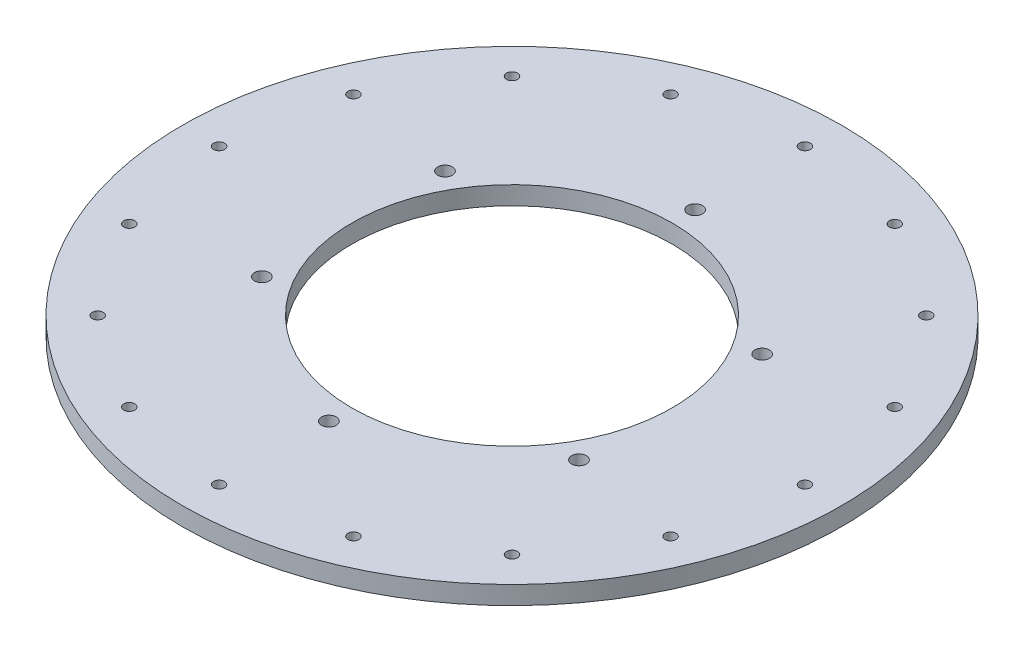
ISO-10303-21;
HEADER;
FILE_DESCRIPTION(('STEP AP214'),'2;1');
FILE_NAME('part.step','',(''),(''),'','','');
FILE_SCHEMA(('AUTOMOTIVE_DESIGN { 1 0 10303 214 1 1 1 1 }'));
ENDSEC;
DATA;
#1=APPLICATION_CONTEXT('core data for automotive mechanical design processes');
#2=APPLICATION_PROTOCOL_DEFINITION('international standard','automotive_design',2000,#1);
#3=PRODUCT_CONTEXT('',#1,'mechanical');
#4=PRODUCT('Part','Part','',(#3));
#5=PRODUCT_RELATED_PRODUCT_CATEGORY('part','',(#4));
#6=PRODUCT_DEFINITION_FORMATION('','',#4);
#7=PRODUCT_DEFINITION_CONTEXT('part definition',#1,'design');
#8=PRODUCT_DEFINITION('design','',#6,#7);
#9=PRODUCT_DEFINITION_SHAPE('','',#8);
#10=(LENGTH_UNIT() NAMED_UNIT(*) SI_UNIT(.MILLI.,.METRE.));
#11=(NAMED_UNIT(*) PLANE_ANGLE_UNIT() SI_UNIT($,.RADIAN.));
#12=(NAMED_UNIT(*) SI_UNIT($,.STERADIAN.) SOLID_ANGLE_UNIT());
#13=UNCERTAINTY_MEASURE_WITH_UNIT(LENGTH_MEASURE(1.E-05),#10,'distance_accuracy_value','');
#14=(GEOMETRIC_REPRESENTATION_CONTEXT(3) GLOBAL_UNCERTAINTY_ASSIGNED_CONTEXT((#13)) GLOBAL_UNIT_ASSIGNED_CONTEXT((#10,
#11,#12)) REPRESENTATION_CONTEXT('',''));
#15=CARTESIAN_POINT('',(0.,0.,0.));
#16=DIRECTION('',(0.,0.,1.));
#17=DIRECTION('',(1.,0.,0.));
#18=AXIS2_PLACEMENT_3D('',#15,#16,#17);
#19=CARTESIAN_POINT('',(0.,10.,0.));
#20=DIRECTION('',(0.,1.,0.));
#21=DIRECTION('',(0.,0.,1.));
#22=AXIS2_PLACEMENT_3D('',#19,#20,#21);
#23=PLANE('',#22);
#24=CARTESIAN_POINT('',(-113.137084989839,10.,-113.137084989827));
#25=DIRECTION('',(0.,1.,0.));
#26=DIRECTION('',(0.,0.,1.));
#27=AXIS2_PLACEMENT_3D('',#24,#25,#26);
#28=CIRCLE('',#27,3.00000000001628);
#29=CARTESIAN_POINT('',(-113.137084989839,10.,-110.13708498981));
#30=VERTEX_POINT('',#29);
#31=EDGE_CURVE('E168',#30,#30,#28,.T.);
#32=ORIENTED_EDGE('',*,*,#31,.F.);
#33=EDGE_LOOP('',(#32));
#34=FACE_BOUND('',#33,.T.);
#35=CARTESIAN_POINT('',(-159.99999999997,10.,2.95585778076202E-11));
#36=DIRECTION('',(0.,1.,0.));
#37=DIRECTION('',(0.,0.,1.));
#38=AXIS2_PLACEMENT_3D('',#35,#36,#37);
#39=CIRCLE('',#38,3.0000000000385);
#40=CARTESIAN_POINT('',(-159.99999999997,10.,3.00000000006806));
#41=VERTEX_POINT('',#40);
#42=EDGE_CURVE('E156',#41,#41,#39,.T.);
#43=ORIENTED_EDGE('',*,*,#42,.F.);
#44=EDGE_LOOP('',(#43));
#45=FACE_BOUND('',#44,.T.);
#46=CARTESIAN_POINT('',(-113.137084989797,10.,113.137084989869));
#47=DIRECTION('',(0.,1.,0.));
#48=DIRECTION('',(0.,0.,1.));
#49=AXIS2_PLACEMENT_3D('',#46,#47,#48);
#50=CIRCLE('',#49,3.00000000005567);
#51=CARTESIAN_POINT('',(-113.137084989797,10.,116.137084989924));
#52=VERTEX_POINT('',#51);
#53=EDGE_CURVE('E144',#52,#52,#50,.T.);
#54=ORIENTED_EDGE('',*,*,#53,.F.);
#55=EDGE_LOOP('',(#54));
#56=FACE_BOUND('',#55,.T.);
#57=CARTESIAN_POINT('',(5.90779669176676E-11,10.,160.));
#58=DIRECTION('',(0.,1.,0.));
#59=DIRECTION('',(0.,0.,1.));
#60=AXIS2_PLACEMENT_3D('',#57,#58,#59);
#61=CIRCLE('',#60,3.00000000005757);
#62=CARTESIAN_POINT('',(5.90779669176676E-11,10.,163.000000000058));
#63=VERTEX_POINT('',#62);
#64=EDGE_CURVE('E132',#63,#63,#61,.T.);
#65=ORIENTED_EDGE('',*,*,#64,.F.);
#66=EDGE_LOOP('',(#65));
#67=FACE_BOUND('',#66,.T.);
#68=CARTESIAN_POINT('',(113.137084989898,10.,113.137084989827));
#69=DIRECTION('',(0.,1.,0.));
#70=DIRECTION('',(0.,0.,1.));
#71=AXIS2_PLACEMENT_3D('',#68,#69,#70);
#72=CIRCLE('',#71,3.00000000004294);
#73=CARTESIAN_POINT('',(113.137084989898,10.,116.13708498987));
#74=VERTEX_POINT('',#73);
#75=EDGE_CURVE('E120',#74,#74,#72,.T.);
#76=ORIENTED_EDGE('',*,*,#75,.F.);
#77=EDGE_LOOP('',(#76));
#78=FACE_BOUND('',#77,.T.);
#79=CARTESIAN_POINT('',(160.00000000003,10.,-2.95389834588338E-11));
#80=DIRECTION('',(0.,1.,0.));
#81=DIRECTION('',(0.,0.,1.));
#82=AXIS2_PLACEMENT_3D('',#79,#80,#81);
#83=CIRCLE('',#82,3.00000000002015);
#84=CARTESIAN_POINT('',(160.00000000003,10.,2.99999999999062));
#85=VERTEX_POINT('',#84);
#86=EDGE_CURVE('E108',#85,#85,#83,.T.);
#87=ORIENTED_EDGE('',*,*,#86,.F.);
#88=EDGE_LOOP('',(#87));
#89=FACE_BOUND('',#88,.T.);
#90=CARTESIAN_POINT('',(-86.6025403784439,10.,-50.));
#91=DIRECTION('',(0.,1.,0.));
#92=DIRECTION('',(0.,0.,1.));
#93=AXIS2_PLACEMENT_3D('',#90,#91,#92);
#94=CIRCLE('',#93,4.00000000000001);
#95=CARTESIAN_POINT('',(-86.6025403784439,10.,-46.));
#96=VERTEX_POINT('',#95);
#97=EDGE_CURVE('E96',#96,#96,#94,.T.);
#98=ORIENTED_EDGE('',*,*,#97,.F.);
#99=EDGE_LOOP('',(#98));
#100=FACE_BOUND('',#99,.T.);
#101=CARTESIAN_POINT('',(61.2293491784166,10.,-147.820725201817));
#102=DIRECTION('',(0.,1.,0.));
#103=DIRECTION('',(0.,0.,1.));
#104=AXIS2_PLACEMENT_3D('',#101,#102,#103);
#105=CIRCLE('',#104,2.99999999999905);
#106=CARTESIAN_POINT('',(61.2293491784166,10.,-144.820725201818));
#107=VERTEX_POINT('',#106);
#108=EDGE_CURVE('E84',#107,#107,#105,.T.);
#109=ORIENTED_EDGE('',*,*,#108,.F.);
#110=EDGE_LOOP('',(#109));
#111=FACE_BOUND('',#110,.T.);
#112=CARTESIAN_POINT('',(0.,10.,100.));
#113=DIRECTION('',(0.,1.,0.));
#114=DIRECTION('',(0.,0.,1.));
#115=AXIS2_PLACEMENT_3D('',#112,#113,#114);
#116=CIRCLE('',#115,4.);
#117=CARTESIAN_POINT('',(0.,10.,104.));
#118=VERTEX_POINT('',#117);
#119=EDGE_CURVE('E72',#118,#118,#116,.T.);
#120=ORIENTED_EDGE('',*,*,#119,.F.);
#121=EDGE_LOOP('',(#120));
#122=FACE_BOUND('',#121,.T.);
#123=CARTESIAN_POINT('',(86.6025403784438,10.,-50.));
#124=DIRECTION('',(0.,1.,0.));
#125=DIRECTION('',(0.,0.,1.));
#126=AXIS2_PLACEMENT_3D('',#123,#124,#125);
#127=CIRCLE('',#126,4.00000000000001);
#128=CARTESIAN_POINT('',(86.6025403784438,10.,-46.));
#129=VERTEX_POINT('',#128);
#130=EDGE_CURVE('E60',#129,#129,#127,.T.);
#131=ORIENTED_EDGE('',*,*,#130,.F.);
#132=EDGE_LOOP('',(#131));
#133=FACE_BOUND('',#132,.T.);
#134=CARTESIAN_POINT('',(0.,10.,-100.));
#135=DIRECTION('',(0.,1.,0.));
#136=DIRECTION('',(0.,0.,1.));
#137=AXIS2_PLACEMENT_3D('',#134,#135,#136);
#138=CIRCLE('',#137,4.);
#139=CARTESIAN_POINT('',(0.,10.,-96.));
#140=VERTEX_POINT('',#139);
#141=EDGE_CURVE('E48',#140,#140,#138,.T.);
#142=ORIENTED_EDGE('',*,*,#141,.F.);
#143=EDGE_LOOP('',(#142));
#144=FACE_BOUND('',#143,.T.);
#145=CARTESIAN_POINT('',(0.,10.,0.));
#146=DIRECTION('',(0.,1.,0.));
#147=DIRECTION('',(0.,0.,1.));
#148=AXIS2_PLACEMENT_3D('',#145,#146,#147);
#149=CIRCLE('',#148,180.);
#150=CARTESIAN_POINT('',(0.,10.,180.));
#151=VERTEX_POINT('',#150);
#152=EDGE_CURVE('E10',#151,#151,#149,.T.);
#153=ORIENTED_EDGE('',*,*,#152,.T.);
#154=EDGE_LOOP('',(#153));
#155=FACE_BOUND('',#154,.T.);
#156=CARTESIAN_POINT('',(0.,10.,0.));
#157=DIRECTION('',(0.,1.,0.));
#158=DIRECTION('',(0.,0.,1.));
#159=AXIS2_PLACEMENT_3D('',#156,#157,#158);
#160=CIRCLE('',#159,87.5);
#161=CARTESIAN_POINT('',(0.,10.,87.5));
#162=VERTEX_POINT('',#161);
#163=EDGE_CURVE('E43',#162,#162,#160,.T.);
#164=ORIENTED_EDGE('',*,*,#163,.F.);
#165=EDGE_LOOP('',(#164));
#166=FACE_BOUND('',#165,.T.);
#167=CARTESIAN_POINT('',(0.,10.,-160.));
#168=DIRECTION('',(0.,1.,0.));
#169=DIRECTION('',(0.,0.,1.));
#170=AXIS2_PLACEMENT_3D('',#167,#168,#169);
#171=CIRCLE('',#170,3.);
#172=CARTESIAN_POINT('',(0.,10.,-157.));
#173=VERTEX_POINT('',#172);
#174=EDGE_CURVE('E54',#173,#173,#171,.T.);
#175=ORIENTED_EDGE('',*,*,#174,.F.);
#176=EDGE_LOOP('',(#175));
#177=FACE_BOUND('',#176,.T.);
#178=CARTESIAN_POINT('',(86.6025403784438,10.,50.));
#179=DIRECTION('',(0.,1.,0.));
#180=DIRECTION('',(0.,0.,1.));
#181=AXIS2_PLACEMENT_3D('',#178,#179,#180);
#182=CIRCLE('',#181,4.00000000000001);
#183=CARTESIAN_POINT('',(86.6025403784438,10.,54.));
#184=VERTEX_POINT('',#183);
#185=EDGE_CURVE('E66',#184,#184,#182,.T.);
#186=ORIENTED_EDGE('',*,*,#185,.F.);
#187=EDGE_LOOP('',(#186));
#188=FACE_BOUND('',#187,.T.);
#189=CARTESIAN_POINT('',(-86.6025403784439,10.,50.));
#190=DIRECTION('',(0.,1.,0.));
#191=DIRECTION('',(0.,0.,1.));
#192=AXIS2_PLACEMENT_3D('',#189,#190,#191);
#193=CIRCLE('',#192,4.00000000000001);
#194=CARTESIAN_POINT('',(-86.6025403784439,10.,54.));
#195=VERTEX_POINT('',#194);
#196=EDGE_CURVE('E78',#195,#195,#193,.T.);
#197=ORIENTED_EDGE('',*,*,#196,.F.);
#198=EDGE_LOOP('',(#197));
#199=FACE_BOUND('',#198,.T.);
#200=CARTESIAN_POINT('',(113.137084989856,10.,-113.137084989869));
#201=DIRECTION('',(0.,1.,0.));
#202=DIRECTION('',(0.,0.,1.));
#203=AXIS2_PLACEMENT_3D('',#200,#201,#202);
#204=CIRCLE('',#203,3.00000000000243);
#205=CARTESIAN_POINT('',(113.137084989856,10.,-110.137084989866));
#206=VERTEX_POINT('',#205);
#207=EDGE_CURVE('E90',#206,#206,#204,.T.);
#208=ORIENTED_EDGE('',*,*,#207,.F.);
#209=EDGE_LOOP('',(#208));
#210=FACE_BOUND('',#209,.T.);
#211=CARTESIAN_POINT('',(147.820725201824,10.,-61.2293491784417));
#212=DIRECTION('',(0.,1.,0.));
#213=DIRECTION('',(0.,0.,1.));
#214=AXIS2_PLACEMENT_3D('',#211,#212,#213);
#215=CIRCLE('',#214,3.00000000000983);
#216=CARTESIAN_POINT('',(147.820725201824,10.,-58.2293491784318));
#217=VERTEX_POINT('',#216);
#218=EDGE_CURVE('E102',#217,#217,#215,.T.);
#219=ORIENTED_EDGE('',*,*,#218,.F.);
#220=EDGE_LOOP('',(#219));
#221=FACE_BOUND('',#220,.T.);
#222=CARTESIAN_POINT('',(147.820725201847,10.,61.2293491783871));
#223=DIRECTION('',(0.,1.,0.));
#224=DIRECTION('',(0.,0.,1.));
#225=AXIS2_PLACEMENT_3D('',#222,#223,#224);
#226=CIRCLE('',#225,3.00000000003175);
#227=CARTESIAN_POINT('',(147.820725201847,10.,64.2293491784188));
#228=VERTEX_POINT('',#227);
#229=EDGE_CURVE('E114',#228,#228,#226,.T.);
#230=ORIENTED_EDGE('',*,*,#229,.F.);
#231=EDGE_LOOP('',(#230));
#232=FACE_BOUND('',#231,.T.);
#233=CARTESIAN_POINT('',(61.2293491784712,10.,147.820725201795));
#234=DIRECTION('',(0.,1.,0.));
#235=DIRECTION('',(0.,0.,1.));
#236=AXIS2_PLACEMENT_3D('',#233,#234,#235);
#237=CIRCLE('',#236,3.00000000005197);
#238=CARTESIAN_POINT('',(61.2293491784712,10.,150.820725201847));
#239=VERTEX_POINT('',#238);
#240=EDGE_CURVE('E126',#239,#239,#237,.T.);
#241=ORIENTED_EDGE('',*,*,#240,.F.);
#242=EDGE_LOOP('',(#241));
#243=FACE_BOUND('',#242,.T.);
#244=CARTESIAN_POINT('',(-61.2293491783575,10.,147.820725201817));
#245=DIRECTION('',(0.,1.,0.));
#246=DIRECTION('',(0.,0.,1.));
#247=AXIS2_PLACEMENT_3D('',#244,#245,#246);
#248=CIRCLE('',#247,3.00000000005889);
#249=CARTESIAN_POINT('',(-61.2293491783575,10.,150.820725201876));
#250=VERTEX_POINT('',#249);
#251=EDGE_CURVE('E138',#250,#250,#248,.T.);
#252=ORIENTED_EDGE('',*,*,#251,.F.);
#253=EDGE_LOOP('',(#252));
#254=FACE_BOUND('',#253,.T.);
#255=CARTESIAN_POINT('',(-147.820725201765,10.,61.2293491784417));
#256=DIRECTION('',(0.,1.,0.));
#257=DIRECTION('',(0.,0.,1.));
#258=AXIS2_PLACEMENT_3D('',#255,#256,#257);
#259=CIRCLE('',#258,3.00000000004867);
#260=CARTESIAN_POINT('',(-147.820725201765,10.,64.2293491784904));
#261=VERTEX_POINT('',#260);
#262=EDGE_CURVE('E150',#261,#261,#259,.T.);
#263=ORIENTED_EDGE('',*,*,#262,.F.);
#264=EDGE_LOOP('',(#263));
#265=FACE_BOUND('',#264,.T.);
#266=CARTESIAN_POINT('',(-147.820725201788,10.,-61.2293491783871));
#267=DIRECTION('',(0.,1.,0.));
#268=DIRECTION('',(0.,0.,1.));
#269=AXIS2_PLACEMENT_3D('',#266,#267,#268);
#270=CIRCLE('',#269,3.00000000002704);
#271=CARTESIAN_POINT('',(-147.820725201788,10.,-58.2293491783601));
#272=VERTEX_POINT('',#271);
#273=EDGE_CURVE('E162',#272,#272,#270,.T.);
#274=ORIENTED_EDGE('',*,*,#273,.F.);
#275=EDGE_LOOP('',(#274));
#276=FACE_BOUND('',#275,.T.);
#277=CARTESIAN_POINT('',(-61.2293491784122,10.,-147.820725201795));
#278=DIRECTION('',(0.,1.,0.));
#279=DIRECTION('',(0.,0.,1.));
#280=AXIS2_PLACEMENT_3D('',#277,#278,#279);
#281=CIRCLE('',#280,3.00000000000766);
#282=CARTESIAN_POINT('',(-61.2293491784122,10.,-144.820725201787));
#283=VERTEX_POINT('',#282);
#284=EDGE_CURVE('E174',#283,#283,#281,.T.);
#285=ORIENTED_EDGE('',*,*,#284,.F.);
#286=EDGE_LOOP('',(#285));
#287=FACE_BOUND('',#286,.T.);
#288=ADVANCED_FACE('F32',(#34,#45,#56,#67,#78,#89,#100,#111,#122,#133,#144,#155,#166,#177,#188,
#199,#210,#221,#232,#243,#254,#265,#276,#287),#23,.T.);
#289=CARTESIAN_POINT('',(0.,0.,0.));
#290=DIRECTION('',(0.,1.,0.));
#291=DIRECTION('',(0.,0.,1.));
#292=AXIS2_PLACEMENT_3D('',#289,#290,#291);
#293=PLANE('',#292);
#294=CARTESIAN_POINT('',(0.,0.,0.));
#295=DIRECTION('',(0.,1.,0.));
#296=DIRECTION('',(0.,0.,1.));
#297=AXIS2_PLACEMENT_3D('',#294,#295,#296);
#298=CIRCLE('',#297,180.);
#299=CARTESIAN_POINT('',(0.,0.,180.));
#300=VERTEX_POINT('',#299);
#301=EDGE_CURVE('E36',#300,#300,#298,.T.);
#302=ORIENTED_EDGE('',*,*,#301,.F.);
#303=EDGE_LOOP('',(#302));
#304=FACE_BOUND('',#303,.T.);
#305=CARTESIAN_POINT('',(0.,0.,0.));
#306=DIRECTION('',(0.,1.,0.));
#307=DIRECTION('',(0.,0.,1.));
#308=AXIS2_PLACEMENT_3D('',#305,#306,#307);
#309=CIRCLE('',#308,87.5);
#310=CARTESIAN_POINT('',(0.,0.,87.5));
#311=VERTEX_POINT('',#310);
#312=EDGE_CURVE('E45',#311,#311,#309,.T.);
#313=ORIENTED_EDGE('',*,*,#312,.T.);
#314=EDGE_LOOP('',(#313));
#315=FACE_BOUND('',#314,.T.);
#316=CARTESIAN_POINT('',(0.,0.,-100.));
#317=DIRECTION('',(0.,1.,0.));
#318=DIRECTION('',(0.,0.,1.));
#319=AXIS2_PLACEMENT_3D('',#316,#317,#318);
#320=CIRCLE('',#319,4.);
#321=CARTESIAN_POINT('',(0.,0.,-96.));
#322=VERTEX_POINT('',#321);
#323=EDGE_CURVE('E51',#322,#322,#320,.T.);
#324=ORIENTED_EDGE('',*,*,#323,.T.);
#325=EDGE_LOOP('',(#324));
#326=FACE_BOUND('',#325,.T.);
#327=CARTESIAN_POINT('',(0.,0.,-160.));
#328=DIRECTION('',(0.,1.,0.));
#329=DIRECTION('',(0.,0.,1.));
#330=AXIS2_PLACEMENT_3D('',#327,#328,#329);
#331=CIRCLE('',#330,3.);
#332=CARTESIAN_POINT('',(0.,0.,-157.));
#333=VERTEX_POINT('',#332);
#334=EDGE_CURVE('E57',#333,#333,#331,.T.);
#335=ORIENTED_EDGE('',*,*,#334,.T.);
#336=EDGE_LOOP('',(#335));
#337=FACE_BOUND('',#336,.T.);
#338=CARTESIAN_POINT('',(86.6025403784438,0.,-50.));
#339=DIRECTION('',(0.,1.,0.));
#340=DIRECTION('',(0.,0.,1.));
#341=AXIS2_PLACEMENT_3D('',#338,#339,#340);
#342=CIRCLE('',#341,4.00000000000001);
#343=CARTESIAN_POINT('',(86.6025403784438,0.,-46.));
#344=VERTEX_POINT('',#343);
#345=EDGE_CURVE('E63',#344,#344,#342,.T.);
#346=ORIENTED_EDGE('',*,*,#345,.T.);
#347=EDGE_LOOP('',(#346));
#348=FACE_BOUND('',#347,.T.);
#349=CARTESIAN_POINT('',(86.6025403784438,0.,50.));
#350=DIRECTION('',(0.,1.,0.));
#351=DIRECTION('',(0.,0.,1.));
#352=AXIS2_PLACEMENT_3D('',#349,#350,#351);
#353=CIRCLE('',#352,4.00000000000001);
#354=CARTESIAN_POINT('',(86.6025403784438,0.,54.));
#355=VERTEX_POINT('',#354);
#356=EDGE_CURVE('E69',#355,#355,#353,.T.);
#357=ORIENTED_EDGE('',*,*,#356,.T.);
#358=EDGE_LOOP('',(#357));
#359=FACE_BOUND('',#358,.T.);
#360=CARTESIAN_POINT('',(0.,0.,100.));
#361=DIRECTION('',(0.,1.,0.));
#362=DIRECTION('',(0.,0.,1.));
#363=AXIS2_PLACEMENT_3D('',#360,#361,#362);
#364=CIRCLE('',#363,4.);
#365=CARTESIAN_POINT('',(0.,0.,104.));
#366=VERTEX_POINT('',#365);
#367=EDGE_CURVE('E75',#366,#366,#364,.T.);
#368=ORIENTED_EDGE('',*,*,#367,.T.);
#369=EDGE_LOOP('',(#368));
#370=FACE_BOUND('',#369,.T.);
#371=CARTESIAN_POINT('',(-86.6025403784439,0.,50.));
#372=DIRECTION('',(0.,1.,0.));
#373=DIRECTION('',(0.,0.,1.));
#374=AXIS2_PLACEMENT_3D('',#371,#372,#373);
#375=CIRCLE('',#374,4.00000000000001);
#376=CARTESIAN_POINT('',(-86.6025403784439,0.,54.));
#377=VERTEX_POINT('',#376);
#378=EDGE_CURVE('E81',#377,#377,#375,.T.);
#379=ORIENTED_EDGE('',*,*,#378,.T.);
#380=EDGE_LOOP('',(#379));
#381=FACE_BOUND('',#380,.T.);
#382=CARTESIAN_POINT('',(61.2293491784166,0.,-147.820725201817));
#383=DIRECTION('',(0.,1.,0.));
#384=DIRECTION('',(0.,0.,1.));
#385=AXIS2_PLACEMENT_3D('',#382,#383,#384);
#386=CIRCLE('',#385,2.99999999999905);
#387=CARTESIAN_POINT('',(61.2293491784166,0.,-144.820725201818));
#388=VERTEX_POINT('',#387);
#389=EDGE_CURVE('E87',#388,#388,#386,.T.);
#390=ORIENTED_EDGE('',*,*,#389,.T.);
#391=EDGE_LOOP('',(#390));
#392=FACE_BOUND('',#391,.T.);
#393=CARTESIAN_POINT('',(113.137084989856,0.,-113.137084989869));
#394=DIRECTION('',(0.,1.,0.));
#395=DIRECTION('',(0.,0.,1.));
#396=AXIS2_PLACEMENT_3D('',#393,#394,#395);
#397=CIRCLE('',#396,3.00000000000243);
#398=CARTESIAN_POINT('',(113.137084989856,0.,-110.137084989866));
#399=VERTEX_POINT('',#398);
#400=EDGE_CURVE('E93',#399,#399,#397,.T.);
#401=ORIENTED_EDGE('',*,*,#400,.T.);
#402=EDGE_LOOP('',(#401));
#403=FACE_BOUND('',#402,.T.);
#404=CARTESIAN_POINT('',(-86.6025403784439,0.,-50.));
#405=DIRECTION('',(0.,1.,0.));
#406=DIRECTION('',(0.,0.,1.));
#407=AXIS2_PLACEMENT_3D('',#404,#405,#406);
#408=CIRCLE('',#407,4.00000000000001);
#409=CARTESIAN_POINT('',(-86.6025403784439,0.,-46.));
#410=VERTEX_POINT('',#409);
#411=EDGE_CURVE('E99',#410,#410,#408,.T.);
#412=ORIENTED_EDGE('',*,*,#411,.T.);
#413=EDGE_LOOP('',(#412));
#414=FACE_BOUND('',#413,.T.);
#415=CARTESIAN_POINT('',(147.820725201824,0.,-61.2293491784417));
#416=DIRECTION('',(0.,1.,0.));
#417=DIRECTION('',(0.,0.,1.));
#418=AXIS2_PLACEMENT_3D('',#415,#416,#417);
#419=CIRCLE('',#418,3.00000000000983);
#420=CARTESIAN_POINT('',(147.820725201824,0.,-58.2293491784318));
#421=VERTEX_POINT('',#420);
#422=EDGE_CURVE('E105',#421,#421,#419,.T.);
#423=ORIENTED_EDGE('',*,*,#422,.T.);
#424=EDGE_LOOP('',(#423));
#425=FACE_BOUND('',#424,.T.);
#426=CARTESIAN_POINT('',(160.00000000003,0.,-2.95389834588338E-11));
#427=DIRECTION('',(0.,1.,0.));
#428=DIRECTION('',(0.,0.,1.));
#429=AXIS2_PLACEMENT_3D('',#426,#427,#428);
#430=CIRCLE('',#429,3.00000000002015);
#431=CARTESIAN_POINT('',(160.00000000003,0.,2.99999999999062));
#432=VERTEX_POINT('',#431);
#433=EDGE_CURVE('E111',#432,#432,#430,.T.);
#434=ORIENTED_EDGE('',*,*,#433,.T.);
#435=EDGE_LOOP('',(#434));
#436=FACE_BOUND('',#435,.T.);
#437=CARTESIAN_POINT('',(147.820725201847,0.,61.2293491783871));
#438=DIRECTION('',(0.,1.,0.));
#439=DIRECTION('',(0.,0.,1.));
#440=AXIS2_PLACEMENT_3D('',#437,#438,#439);
#441=CIRCLE('',#440,3.00000000003175);
#442=CARTESIAN_POINT('',(147.820725201847,0.,64.2293491784188));
#443=VERTEX_POINT('',#442);
#444=EDGE_CURVE('E117',#443,#443,#441,.T.);
#445=ORIENTED_EDGE('',*,*,#444,.T.);
#446=EDGE_LOOP('',(#445));
#447=FACE_BOUND('',#446,.T.);
#448=CARTESIAN_POINT('',(113.137084989898,0.,113.137084989827));
#449=DIRECTION('',(0.,1.,0.));
#450=DIRECTION('',(0.,0.,1.));
#451=AXIS2_PLACEMENT_3D('',#448,#449,#450);
#452=CIRCLE('',#451,3.00000000004294);
#453=CARTESIAN_POINT('',(113.137084989898,0.,116.13708498987));
#454=VERTEX_POINT('',#453);
#455=EDGE_CURVE('E123',#454,#454,#452,.T.);
#456=ORIENTED_EDGE('',*,*,#455,.T.);
#457=EDGE_LOOP('',(#456));
#458=FACE_BOUND('',#457,.T.);
#459=CARTESIAN_POINT('',(61.2293491784712,0.,147.820725201795));
#460=DIRECTION('',(0.,1.,0.));
#461=DIRECTION('',(0.,0.,1.));
#462=AXIS2_PLACEMENT_3D('',#459,#460,#461);
#463=CIRCLE('',#462,3.00000000005197);
#464=CARTESIAN_POINT('',(61.2293491784712,0.,150.820725201847));
#465=VERTEX_POINT('',#464);
#466=EDGE_CURVE('E129',#465,#465,#463,.T.);
#467=ORIENTED_EDGE('',*,*,#466,.T.);
#468=EDGE_LOOP('',(#467));
#469=FACE_BOUND('',#468,.T.);
#470=CARTESIAN_POINT('',(5.90779669176676E-11,0.,160.));
#471=DIRECTION('',(0.,1.,0.));
#472=DIRECTION('',(0.,0.,1.));
#473=AXIS2_PLACEMENT_3D('',#470,#471,#472);
#474=CIRCLE('',#473,3.00000000005757);
#475=CARTESIAN_POINT('',(5.90779669176676E-11,0.,163.000000000058));
#476=VERTEX_POINT('',#475);
#477=EDGE_CURVE('E135',#476,#476,#474,.T.);
#478=ORIENTED_EDGE('',*,*,#477,.T.);
#479=EDGE_LOOP('',(#478));
#480=FACE_BOUND('',#479,.T.);
#481=CARTESIAN_POINT('',(-61.2293491783575,0.,147.820725201817));
#482=DIRECTION('',(0.,1.,0.));
#483=DIRECTION('',(0.,0.,1.));
#484=AXIS2_PLACEMENT_3D('',#481,#482,#483);
#485=CIRCLE('',#484,3.00000000005889);
#486=CARTESIAN_POINT('',(-61.2293491783575,0.,150.820725201876));
#487=VERTEX_POINT('',#486);
#488=EDGE_CURVE('E141',#487,#487,#485,.T.);
#489=ORIENTED_EDGE('',*,*,#488,.T.);
#490=EDGE_LOOP('',(#489));
#491=FACE_BOUND('',#490,.T.);
#492=CARTESIAN_POINT('',(-113.137084989797,0.,113.137084989869));
#493=DIRECTION('',(0.,1.,0.));
#494=DIRECTION('',(0.,0.,1.));
#495=AXIS2_PLACEMENT_3D('',#492,#493,#494);
#496=CIRCLE('',#495,3.00000000005567);
#497=CARTESIAN_POINT('',(-113.137084989797,0.,116.137084989924));
#498=VERTEX_POINT('',#497);
#499=EDGE_CURVE('E147',#498,#498,#496,.T.);
#500=ORIENTED_EDGE('',*,*,#499,.T.);
#501=EDGE_LOOP('',(#500));
#502=FACE_BOUND('',#501,.T.);
#503=CARTESIAN_POINT('',(-147.820725201765,0.,61.2293491784417));
#504=DIRECTION('',(0.,1.,0.));
#505=DIRECTION('',(0.,0.,1.));
#506=AXIS2_PLACEMENT_3D('',#503,#504,#505);
#507=CIRCLE('',#506,3.00000000004867);
#508=CARTESIAN_POINT('',(-147.820725201765,0.,64.2293491784904));
#509=VERTEX_POINT('',#508);
#510=EDGE_CURVE('E153',#509,#509,#507,.T.);
#511=ORIENTED_EDGE('',*,*,#510,.T.);
#512=EDGE_LOOP('',(#511));
#513=FACE_BOUND('',#512,.T.);
#514=CARTESIAN_POINT('',(-159.99999999997,0.,2.95585778076202E-11));
#515=DIRECTION('',(0.,1.,0.));
#516=DIRECTION('',(0.,0.,1.));
#517=AXIS2_PLACEMENT_3D('',#514,#515,#516);
#518=CIRCLE('',#517,3.0000000000385);
#519=CARTESIAN_POINT('',(-159.99999999997,0.,3.00000000006806));
#520=VERTEX_POINT('',#519);
#521=EDGE_CURVE('E159',#520,#520,#518,.T.);
#522=ORIENTED_EDGE('',*,*,#521,.T.);
#523=EDGE_LOOP('',(#522));
#524=FACE_BOUND('',#523,.T.);
#525=CARTESIAN_POINT('',(-147.820725201788,0.,-61.2293491783871));
#526=DIRECTION('',(0.,1.,0.));
#527=DIRECTION('',(0.,0.,1.));
#528=AXIS2_PLACEMENT_3D('',#525,#526,#527);
#529=CIRCLE('',#528,3.00000000002704);
#530=CARTESIAN_POINT('',(-147.820725201788,0.,-58.2293491783601));
#531=VERTEX_POINT('',#530);
#532=EDGE_CURVE('E165',#531,#531,#529,.T.);
#533=ORIENTED_EDGE('',*,*,#532,.T.);
#534=EDGE_LOOP('',(#533));
#535=FACE_BOUND('',#534,.T.);
#536=CARTESIAN_POINT('',(-113.137084989839,0.,-113.137084989827));
#537=DIRECTION('',(0.,1.,0.));
#538=DIRECTION('',(0.,0.,1.));
#539=AXIS2_PLACEMENT_3D('',#536,#537,#538);
#540=CIRCLE('',#539,3.00000000001628);
#541=CARTESIAN_POINT('',(-113.137084989839,0.,-110.13708498981));
#542=VERTEX_POINT('',#541);
#543=EDGE_CURVE('E171',#542,#542,#540,.T.);
#544=ORIENTED_EDGE('',*,*,#543,.T.);
#545=EDGE_LOOP('',(#544));
#546=FACE_BOUND('',#545,.T.);
#547=CARTESIAN_POINT('',(-61.2293491784122,0.,-147.820725201795));
#548=DIRECTION('',(0.,1.,0.));
#549=DIRECTION('',(0.,0.,1.));
#550=AXIS2_PLACEMENT_3D('',#547,#548,#549);
#551=CIRCLE('',#550,3.00000000000766);
#552=CARTESIAN_POINT('',(-61.2293491784122,0.,-144.820725201787));
#553=VERTEX_POINT('',#552);
#554=EDGE_CURVE('E177',#553,#553,#551,.T.);
#555=ORIENTED_EDGE('',*,*,#554,.T.);
#556=EDGE_LOOP('',(#555));
#557=FACE_BOUND('',#556,.T.);
#558=ADVANCED_FACE('F187',(#304,#315,#326,#337,#348,#359,#370,#381,#392,#403,#414,#425,#436,
#447,#458,#469,#480,#491,#502,#513,#524,#535,#546,#557),#293,.F.);
#559=CARTESIAN_POINT('',(0.,10.,0.));
#560=DIRECTION('',(0.,-1.,0.));
#561=DIRECTION('',(0.,0.,-1.));
#562=AXIS2_PLACEMENT_3D('',#559,#560,#561);
#563=CYLINDRICAL_SURFACE('',#562,180.);
#564=ORIENTED_EDGE('',*,*,#152,.F.);
#565=EDGE_LOOP('',(#564));
#566=FACE_BOUND('',#565,.T.);
#567=ORIENTED_EDGE('',*,*,#301,.T.);
#568=EDGE_LOOP('',(#567));
#569=FACE_BOUND('',#568,.T.);
#570=ADVANCED_FACE('F34',(#566,#569),#563,.T.);
#571=CARTESIAN_POINT('',(0.,10.,0.));
#572=DIRECTION('',(0.,-1.,0.));
#573=DIRECTION('',(0.,0.,-1.));
#574=AXIS2_PLACEMENT_3D('',#571,#572,#573);
#575=CYLINDRICAL_SURFACE('',#574,87.5);
#576=ORIENTED_EDGE('',*,*,#163,.T.);
#577=EDGE_LOOP('',(#576));
#578=FACE_BOUND('',#577,.T.);
#579=ORIENTED_EDGE('',*,*,#312,.F.);
#580=EDGE_LOOP('',(#579));
#581=FACE_BOUND('',#580,.T.);
#582=ADVANCED_FACE('F197',(#578,#581),#575,.F.);
#583=CARTESIAN_POINT('',(0.,10.,-100.));
#584=DIRECTION('',(0.,-1.,0.));
#585=DIRECTION('',(0.,0.,-1.));
#586=AXIS2_PLACEMENT_3D('',#583,#584,#585);
#587=CYLINDRICAL_SURFACE('',#586,4.);
#588=ORIENTED_EDGE('',*,*,#141,.T.);
#589=EDGE_LOOP('',(#588));
#590=FACE_BOUND('',#589,.T.);
#591=ORIENTED_EDGE('',*,*,#323,.F.);
#592=EDGE_LOOP('',(#591));
#593=FACE_BOUND('',#592,.T.);
#594=ADVANCED_FACE('F200',(#590,#593),#587,.F.);
#595=CARTESIAN_POINT('',(0.,10.,-160.));
#596=DIRECTION('',(0.,-1.,0.));
#597=DIRECTION('',(0.,0.,-1.));
#598=AXIS2_PLACEMENT_3D('',#595,#596,#597);
#599=CYLINDRICAL_SURFACE('',#598,3.);
#600=ORIENTED_EDGE('',*,*,#174,.T.);
#601=EDGE_LOOP('',(#600));
#602=FACE_BOUND('',#601,.T.);
#603=ORIENTED_EDGE('',*,*,#334,.F.);
#604=EDGE_LOOP('',(#603));
#605=FACE_BOUND('',#604,.T.);
#606=ADVANCED_FACE('F204',(#602,#605),#599,.F.);
#607=CARTESIAN_POINT('',(86.6025403784438,10.,-50.));
#608=DIRECTION('',(0.,-1.,0.));
#609=DIRECTION('',(0.,0.,-1.));
#610=AXIS2_PLACEMENT_3D('',#607,#608,#609);
#611=CYLINDRICAL_SURFACE('',#610,4.00000000000001);
#612=ORIENTED_EDGE('',*,*,#130,.T.);
#613=EDGE_LOOP('',(#612));
#614=FACE_BOUND('',#613,.T.);
#615=ORIENTED_EDGE('',*,*,#345,.F.);
#616=EDGE_LOOP('',(#615));
#617=FACE_BOUND('',#616,.T.);
#618=ADVANCED_FACE('F208',(#614,#617),#611,.F.);
#619=CARTESIAN_POINT('',(86.6025403784438,10.,50.));
#620=DIRECTION('',(0.,-1.,0.));
#621=DIRECTION('',(0.,0.,-1.));
#622=AXIS2_PLACEMENT_3D('',#619,#620,#621);
#623=CYLINDRICAL_SURFACE('',#622,4.00000000000001);
#624=ORIENTED_EDGE('',*,*,#185,.T.);
#625=EDGE_LOOP('',(#624));
#626=FACE_BOUND('',#625,.T.);
#627=ORIENTED_EDGE('',*,*,#356,.F.);
#628=EDGE_LOOP('',(#627));
#629=FACE_BOUND('',#628,.T.);
#630=ADVANCED_FACE('F212',(#626,#629),#623,.F.);
#631=CARTESIAN_POINT('',(0.,10.,100.));
#632=DIRECTION('',(0.,-1.,0.));
#633=DIRECTION('',(0.,0.,-1.));
#634=AXIS2_PLACEMENT_3D('',#631,#632,#633);
#635=CYLINDRICAL_SURFACE('',#634,4.);
#636=ORIENTED_EDGE('',*,*,#119,.T.);
#637=EDGE_LOOP('',(#636));
#638=FACE_BOUND('',#637,.T.);
#639=ORIENTED_EDGE('',*,*,#367,.F.);
#640=EDGE_LOOP('',(#639));
#641=FACE_BOUND('',#640,.T.);
#642=ADVANCED_FACE('F216',(#638,#641),#635,.F.);
#643=CARTESIAN_POINT('',(-86.6025403784439,10.,50.));
#644=DIRECTION('',(0.,-1.,0.));
#645=DIRECTION('',(0.,0.,-1.));
#646=AXIS2_PLACEMENT_3D('',#643,#644,#645);
#647=CYLINDRICAL_SURFACE('',#646,4.00000000000001);
#648=ORIENTED_EDGE('',*,*,#196,.T.);
#649=EDGE_LOOP('',(#648));
#650=FACE_BOUND('',#649,.T.);
#651=ORIENTED_EDGE('',*,*,#378,.F.);
#652=EDGE_LOOP('',(#651));
#653=FACE_BOUND('',#652,.T.);
#654=ADVANCED_FACE('F220',(#650,#653),#647,.F.);
#655=CARTESIAN_POINT('',(61.2293491784166,10.,-147.820725201817));
#656=DIRECTION('',(0.,-1.,0.));
#657=DIRECTION('',(0.,0.,-1.));
#658=AXIS2_PLACEMENT_3D('',#655,#656,#657);
#659=CYLINDRICAL_SURFACE('',#658,2.99999999999905);
#660=ORIENTED_EDGE('',*,*,#108,.T.);
#661=EDGE_LOOP('',(#660));
#662=FACE_BOUND('',#661,.T.);
#663=ORIENTED_EDGE('',*,*,#389,.F.);
#664=EDGE_LOOP('',(#663));
#665=FACE_BOUND('',#664,.T.);
#666=ADVANCED_FACE('F224',(#662,#665),#659,.F.);
#667=CARTESIAN_POINT('',(113.137084989856,10.,-113.137084989869));
#668=DIRECTION('',(0.,-1.,0.));
#669=DIRECTION('',(0.,0.,-1.));
#670=AXIS2_PLACEMENT_3D('',#667,#668,#669);
#671=CYLINDRICAL_SURFACE('',#670,3.00000000000243);
#672=ORIENTED_EDGE('',*,*,#207,.T.);
#673=EDGE_LOOP('',(#672));
#674=FACE_BOUND('',#673,.T.);
#675=ORIENTED_EDGE('',*,*,#400,.F.);
#676=EDGE_LOOP('',(#675));
#677=FACE_BOUND('',#676,.T.);
#678=ADVANCED_FACE('F228',(#674,#677),#671,.F.);
#679=CARTESIAN_POINT('',(-86.6025403784439,10.,-50.));
#680=DIRECTION('',(0.,-1.,0.));
#681=DIRECTION('',(0.,0.,-1.));
#682=AXIS2_PLACEMENT_3D('',#679,#680,#681);
#683=CYLINDRICAL_SURFACE('',#682,4.00000000000001);
#684=ORIENTED_EDGE('',*,*,#97,.T.);
#685=EDGE_LOOP('',(#684));
#686=FACE_BOUND('',#685,.T.);
#687=ORIENTED_EDGE('',*,*,#411,.F.);
#688=EDGE_LOOP('',(#687));
#689=FACE_BOUND('',#688,.T.);
#690=ADVANCED_FACE('F232',(#686,#689),#683,.F.);
#691=CARTESIAN_POINT('',(147.820725201824,10.,-61.2293491784417));
#692=DIRECTION('',(0.,-1.,0.));
#693=DIRECTION('',(0.,0.,-1.));
#694=AXIS2_PLACEMENT_3D('',#691,#692,#693);
#695=CYLINDRICAL_SURFACE('',#694,3.00000000000983);
#696=ORIENTED_EDGE('',*,*,#218,.T.);
#697=EDGE_LOOP('',(#696));
#698=FACE_BOUND('',#697,.T.);
#699=ORIENTED_EDGE('',*,*,#422,.F.);
#700=EDGE_LOOP('',(#699));
#701=FACE_BOUND('',#700,.T.);
#702=ADVANCED_FACE('F236',(#698,#701),#695,.F.);
#703=CARTESIAN_POINT('',(160.00000000003,10.,-2.95389834588338E-11));
#704=DIRECTION('',(0.,-1.,0.));
#705=DIRECTION('',(0.,0.,-1.));
#706=AXIS2_PLACEMENT_3D('',#703,#704,#705);
#707=CYLINDRICAL_SURFACE('',#706,3.00000000002015);
#708=ORIENTED_EDGE('',*,*,#86,.T.);
#709=EDGE_LOOP('',(#708));
#710=FACE_BOUND('',#709,.T.);
#711=ORIENTED_EDGE('',*,*,#433,.F.);
#712=EDGE_LOOP('',(#711));
#713=FACE_BOUND('',#712,.T.);
#714=ADVANCED_FACE('F240',(#710,#713),#707,.F.);
#715=CARTESIAN_POINT('',(147.820725201847,10.,61.2293491783871));
#716=DIRECTION('',(0.,-1.,0.));
#717=DIRECTION('',(0.,0.,-1.));
#718=AXIS2_PLACEMENT_3D('',#715,#716,#717);
#719=CYLINDRICAL_SURFACE('',#718,3.00000000003175);
#720=ORIENTED_EDGE('',*,*,#229,.T.);
#721=EDGE_LOOP('',(#720));
#722=FACE_BOUND('',#721,.T.);
#723=ORIENTED_EDGE('',*,*,#444,.F.);
#724=EDGE_LOOP('',(#723));
#725=FACE_BOUND('',#724,.T.);
#726=ADVANCED_FACE('F244',(#722,#725),#719,.F.);
#727=CARTESIAN_POINT('',(113.137084989898,10.,113.137084989827));
#728=DIRECTION('',(0.,-1.,0.));
#729=DIRECTION('',(0.,0.,-1.));
#730=AXIS2_PLACEMENT_3D('',#727,#728,#729);
#731=CYLINDRICAL_SURFACE('',#730,3.00000000004294);
#732=ORIENTED_EDGE('',*,*,#75,.T.);
#733=EDGE_LOOP('',(#732));
#734=FACE_BOUND('',#733,.T.);
#735=ORIENTED_EDGE('',*,*,#455,.F.);
#736=EDGE_LOOP('',(#735));
#737=FACE_BOUND('',#736,.T.);
#738=ADVANCED_FACE('F248',(#734,#737),#731,.F.);
#739=CARTESIAN_POINT('',(61.2293491784712,10.,147.820725201795));
#740=DIRECTION('',(0.,-1.,0.));
#741=DIRECTION('',(0.,0.,-1.));
#742=AXIS2_PLACEMENT_3D('',#739,#740,#741);
#743=CYLINDRICAL_SURFACE('',#742,3.00000000005197);
#744=ORIENTED_EDGE('',*,*,#240,.T.);
#745=EDGE_LOOP('',(#744));
#746=FACE_BOUND('',#745,.T.);
#747=ORIENTED_EDGE('',*,*,#466,.F.);
#748=EDGE_LOOP('',(#747));
#749=FACE_BOUND('',#748,.T.);
#750=ADVANCED_FACE('F252',(#746,#749),#743,.F.);
#751=CARTESIAN_POINT('',(5.90779669176676E-11,10.,160.));
#752=DIRECTION('',(0.,-1.,0.));
#753=DIRECTION('',(0.,0.,-1.));
#754=AXIS2_PLACEMENT_3D('',#751,#752,#753);
#755=CYLINDRICAL_SURFACE('',#754,3.00000000005757);
#756=ORIENTED_EDGE('',*,*,#64,.T.);
#757=EDGE_LOOP('',(#756));
#758=FACE_BOUND('',#757,.T.);
#759=ORIENTED_EDGE('',*,*,#477,.F.);
#760=EDGE_LOOP('',(#759));
#761=FACE_BOUND('',#760,.T.);
#762=ADVANCED_FACE('F256',(#758,#761),#755,.F.);
#763=CARTESIAN_POINT('',(-61.2293491783575,10.,147.820725201817));
#764=DIRECTION('',(0.,-1.,0.));
#765=DIRECTION('',(0.,0.,-1.));
#766=AXIS2_PLACEMENT_3D('',#763,#764,#765);
#767=CYLINDRICAL_SURFACE('',#766,3.00000000005889);
#768=ORIENTED_EDGE('',*,*,#251,.T.);
#769=EDGE_LOOP('',(#768));
#770=FACE_BOUND('',#769,.T.);
#771=ORIENTED_EDGE('',*,*,#488,.F.);
#772=EDGE_LOOP('',(#771));
#773=FACE_BOUND('',#772,.T.);
#774=ADVANCED_FACE('F260',(#770,#773),#767,.F.);
#775=CARTESIAN_POINT('',(-113.137084989797,10.,113.137084989869));
#776=DIRECTION('',(0.,-1.,0.));
#777=DIRECTION('',(0.,0.,-1.));
#778=AXIS2_PLACEMENT_3D('',#775,#776,#777);
#779=CYLINDRICAL_SURFACE('',#778,3.00000000005567);
#780=ORIENTED_EDGE('',*,*,#53,.T.);
#781=EDGE_LOOP('',(#780));
#782=FACE_BOUND('',#781,.T.);
#783=ORIENTED_EDGE('',*,*,#499,.F.);
#784=EDGE_LOOP('',(#783));
#785=FACE_BOUND('',#784,.T.);
#786=ADVANCED_FACE('F264',(#782,#785),#779,.F.);
#787=CARTESIAN_POINT('',(-147.820725201765,10.,61.2293491784417));
#788=DIRECTION('',(0.,-1.,0.));
#789=DIRECTION('',(0.,0.,-1.));
#790=AXIS2_PLACEMENT_3D('',#787,#788,#789);
#791=CYLINDRICAL_SURFACE('',#790,3.00000000004867);
#792=ORIENTED_EDGE('',*,*,#262,.T.);
#793=EDGE_LOOP('',(#792));
#794=FACE_BOUND('',#793,.T.);
#795=ORIENTED_EDGE('',*,*,#510,.F.);
#796=EDGE_LOOP('',(#795));
#797=FACE_BOUND('',#796,.T.);
#798=ADVANCED_FACE('F268',(#794,#797),#791,.F.);
#799=CARTESIAN_POINT('',(-159.99999999997,10.,2.95585778076202E-11));
#800=DIRECTION('',(0.,-1.,0.));
#801=DIRECTION('',(0.,0.,-1.));
#802=AXIS2_PLACEMENT_3D('',#799,#800,#801);
#803=CYLINDRICAL_SURFACE('',#802,3.0000000000385);
#804=ORIENTED_EDGE('',*,*,#42,.T.);
#805=EDGE_LOOP('',(#804));
#806=FACE_BOUND('',#805,.T.);
#807=ORIENTED_EDGE('',*,*,#521,.F.);
#808=EDGE_LOOP('',(#807));
#809=FACE_BOUND('',#808,.T.);
#810=ADVANCED_FACE('F272',(#806,#809),#803,.F.);
#811=CARTESIAN_POINT('',(-147.820725201788,10.,-61.2293491783871));
#812=DIRECTION('',(0.,-1.,0.));
#813=DIRECTION('',(0.,0.,-1.));
#814=AXIS2_PLACEMENT_3D('',#811,#812,#813);
#815=CYLINDRICAL_SURFACE('',#814,3.00000000002704);
#816=ORIENTED_EDGE('',*,*,#273,.T.);
#817=EDGE_LOOP('',(#816));
#818=FACE_BOUND('',#817,.T.);
#819=ORIENTED_EDGE('',*,*,#532,.F.);
#820=EDGE_LOOP('',(#819));
#821=FACE_BOUND('',#820,.T.);
#822=ADVANCED_FACE('F276',(#818,#821),#815,.F.);
#823=CARTESIAN_POINT('',(-113.137084989839,10.,-113.137084989827));
#824=DIRECTION('',(0.,-1.,0.));
#825=DIRECTION('',(0.,0.,-1.));
#826=AXIS2_PLACEMENT_3D('',#823,#824,#825);
#827=CYLINDRICAL_SURFACE('',#826,3.00000000001628);
#828=ORIENTED_EDGE('',*,*,#31,.T.);
#829=EDGE_LOOP('',(#828));
#830=FACE_BOUND('',#829,.T.);
#831=ORIENTED_EDGE('',*,*,#543,.F.);
#832=EDGE_LOOP('',(#831));
#833=FACE_BOUND('',#832,.T.);
#834=ADVANCED_FACE('F280',(#830,#833),#827,.F.);
#835=CARTESIAN_POINT('',(-61.2293491784122,10.,-147.820725201795));
#836=DIRECTION('',(0.,-1.,0.));
#837=DIRECTION('',(0.,0.,-1.));
#838=AXIS2_PLACEMENT_3D('',#835,#836,#837);
#839=CYLINDRICAL_SURFACE('',#838,3.00000000000766);
#840=ORIENTED_EDGE('',*,*,#284,.T.);
#841=EDGE_LOOP('',(#840));
#842=FACE_BOUND('',#841,.T.);
#843=ORIENTED_EDGE('',*,*,#554,.F.);
#844=EDGE_LOOP('',(#843));
#845=FACE_BOUND('',#844,.T.);
#846=ADVANCED_FACE('F183',(#842,#845),#839,.F.);
#847=CLOSED_SHELL('',(#288,#558,#570,#582,#594,#606,#618,#630,#642,#654,#666,#678,#690,#702,
#714,#726,#738,#750,#762,#774,#786,#798,#810,#822,#834,#846));
#848=MANIFOLD_SOLID_BREP('B2',#847);
#849=ADVANCED_BREP_SHAPE_REPRESENTATION('',(#18,#848),#14);
#850=SHAPE_DEFINITION_REPRESENTATION(#9,#849);
ENDSEC;
END-ISO-10303-21;
